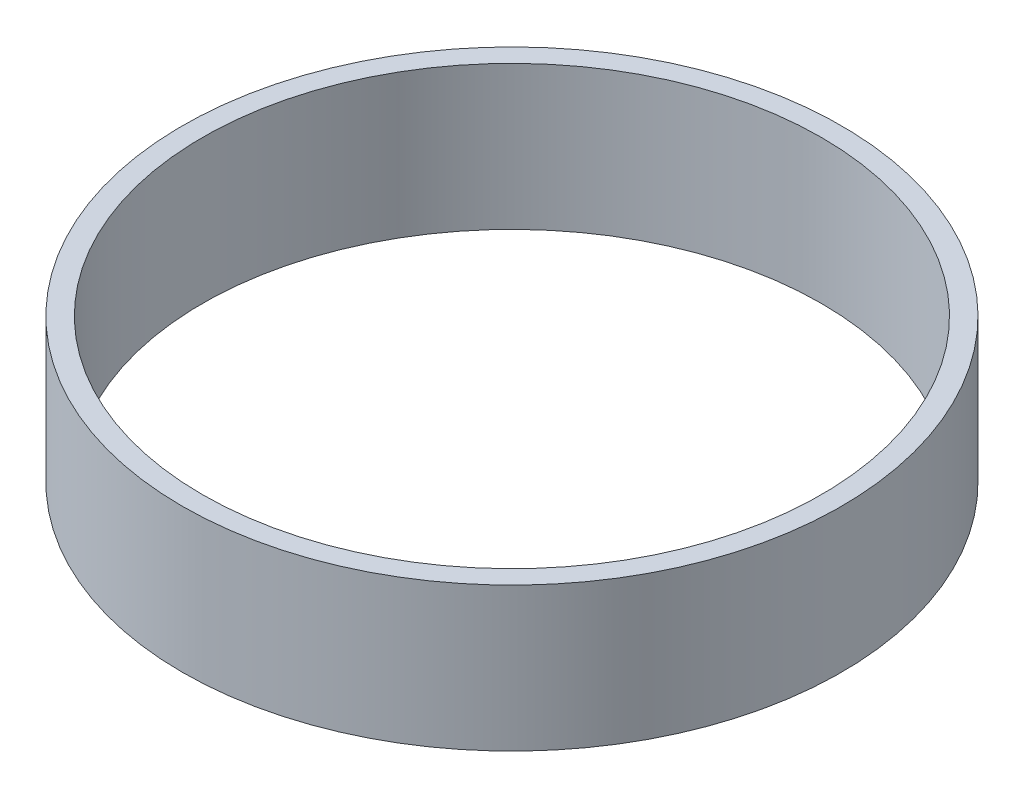
ISO-10303-21;
HEADER;
FILE_DESCRIPTION(('STEP AP214'),'2;1');
FILE_NAME('part.step','',(''),(''),'','','');
FILE_SCHEMA(('AUTOMOTIVE_DESIGN { 1 0 10303 214 1 1 1 1 }'));
ENDSEC;
DATA;
#1=APPLICATION_CONTEXT('core data for automotive mechanical design processes');
#2=APPLICATION_PROTOCOL_DEFINITION('international standard','automotive_design',2000,#1);
#3=PRODUCT_CONTEXT('',#1,'mechanical');
#4=PRODUCT('Part','Part','',(#3));
#5=PRODUCT_RELATED_PRODUCT_CATEGORY('part','',(#4));
#6=PRODUCT_DEFINITION_FORMATION('','',#4);
#7=PRODUCT_DEFINITION_CONTEXT('part definition',#1,'design');
#8=PRODUCT_DEFINITION('design','',#6,#7);
#9=PRODUCT_DEFINITION_SHAPE('','',#8);
#10=(LENGTH_UNIT() NAMED_UNIT(*) SI_UNIT(.MILLI.,.METRE.));
#11=(NAMED_UNIT(*) PLANE_ANGLE_UNIT() SI_UNIT($,.RADIAN.));
#12=(NAMED_UNIT(*) SI_UNIT($,.STERADIAN.) SOLID_ANGLE_UNIT());
#13=UNCERTAINTY_MEASURE_WITH_UNIT(LENGTH_MEASURE(1.E-05),#10,'distance_accuracy_value','');
#14=(GEOMETRIC_REPRESENTATION_CONTEXT(3) GLOBAL_UNCERTAINTY_ASSIGNED_CONTEXT((#13)) GLOBAL_UNIT_ASSIGNED_CONTEXT((#10,
#11,#12)) REPRESENTATION_CONTEXT('',''));
#15=CARTESIAN_POINT('',(0.,0.,0.));
#16=DIRECTION('',(0.,0.,1.));
#17=DIRECTION('',(1.,0.,0.));
#18=AXIS2_PLACEMENT_3D('',#15,#16,#17);
#19=CARTESIAN_POINT('',(0.,12.7,0.));
#20=DIRECTION('',(0.,1.,0.));
#21=DIRECTION('',(0.,0.,1.));
#22=AXIS2_PLACEMENT_3D('',#19,#20,#21);
#23=PLANE('',#22);
#24=CARTESIAN_POINT('',(0.,12.7,0.));
#25=DIRECTION('',(0.,1.,0.));
#26=DIRECTION('',(0.,0.,1.));
#27=AXIS2_PLACEMENT_3D('',#24,#25,#26);
#28=CIRCLE('',#27,29.1084);
#29=CARTESIAN_POINT('',(0.,12.7,29.1084));
#30=VERTEX_POINT('',#29);
#31=EDGE_CURVE('E10',#30,#30,#28,.T.);
#32=ORIENTED_EDGE('',*,*,#31,.T.);
#33=EDGE_LOOP('',(#32));
#34=FACE_BOUND('',#33,.T.);
#35=CARTESIAN_POINT('',(0.,12.7,0.));
#36=DIRECTION('',(0.,1.,0.));
#37=DIRECTION('',(0.,0.,1.));
#38=AXIS2_PLACEMENT_3D('',#35,#36,#37);
#39=CIRCLE('',#38,27.3304);
#40=CARTESIAN_POINT('',(0.,12.7,27.3304));
#41=VERTEX_POINT('',#40);
#42=EDGE_CURVE('E48',#41,#41,#39,.T.);
#43=ORIENTED_EDGE('',*,*,#42,.F.);
#44=EDGE_LOOP('',(#43));
#45=FACE_BOUND('',#44,.T.);
#46=ADVANCED_FACE('F37',(#34,#45),#23,.T.);
#47=CARTESIAN_POINT('',(0.,0.,0.));
#48=DIRECTION('',(0.,1.,0.));
#49=DIRECTION('',(0.,0.,1.));
#50=AXIS2_PLACEMENT_3D('',#47,#48,#49);
#51=PLANE('',#50);
#52=CARTESIAN_POINT('',(0.,0.,0.));
#53=DIRECTION('',(0.,1.,0.));
#54=DIRECTION('',(0.,0.,1.));
#55=AXIS2_PLACEMENT_3D('',#52,#53,#54);
#56=CIRCLE('',#55,29.1084);
#57=CARTESIAN_POINT('',(0.,0.,29.1084));
#58=VERTEX_POINT('',#57);
#59=EDGE_CURVE('E41',#58,#58,#56,.T.);
#60=ORIENTED_EDGE('',*,*,#59,.F.);
#61=EDGE_LOOP('',(#60));
#62=FACE_BOUND('',#61,.T.);
#63=CARTESIAN_POINT('',(0.,0.,0.));
#64=DIRECTION('',(0.,1.,0.));
#65=DIRECTION('',(0.,0.,1.));
#66=AXIS2_PLACEMENT_3D('',#63,#64,#65);
#67=CIRCLE('',#66,27.3304);
#68=CARTESIAN_POINT('',(0.,0.,27.3304));
#69=VERTEX_POINT('',#68);
#70=EDGE_CURVE('E50',#69,#69,#67,.T.);
#71=ORIENTED_EDGE('',*,*,#70,.T.);
#72=EDGE_LOOP('',(#71));
#73=FACE_BOUND('',#72,.T.);
#74=ADVANCED_FACE('F60',(#62,#73),#51,.F.);
#75=CARTESIAN_POINT('',(0.,12.7,0.));
#76=DIRECTION('',(0.,-1.,0.));
#77=DIRECTION('',(0.,0.,-1.));
#78=AXIS2_PLACEMENT_3D('',#75,#76,#77);
#79=CYLINDRICAL_SURFACE('',#78,29.1084);
#80=ORIENTED_EDGE('',*,*,#31,.F.);
#81=EDGE_LOOP('',(#80));
#82=FACE_BOUND('',#81,.T.);
#83=ORIENTED_EDGE('',*,*,#59,.T.);
#84=EDGE_LOOP('',(#83));
#85=FACE_BOUND('',#84,.T.);
#86=ADVANCED_FACE('F39',(#82,#85),#79,.T.);
#87=CARTESIAN_POINT('',(0.,12.7,0.));
#88=DIRECTION('',(0.,-1.,0.));
#89=DIRECTION('',(0.,0.,-1.));
#90=AXIS2_PLACEMENT_3D('',#87,#88,#89);
#91=CYLINDRICAL_SURFACE('',#90,27.3304);
#92=ORIENTED_EDGE('',*,*,#42,.T.);
#93=EDGE_LOOP('',(#92));
#94=FACE_BOUND('',#93,.T.);
#95=ORIENTED_EDGE('',*,*,#70,.F.);
#96=EDGE_LOOP('',(#95));
#97=FACE_BOUND('',#96,.T.);
#98=ADVANCED_FACE('F56',(#94,#97),#91,.F.);
#99=CLOSED_SHELL('',(#46,#74,#86,#98));
#100=MANIFOLD_SOLID_BREP('B2',#99);
#101=ADVANCED_BREP_SHAPE_REPRESENTATION('',(#18,#100),#14);
#102=SHAPE_DEFINITION_REPRESENTATION(#9,#101);
ENDSEC;
END-ISO-10303-21;
